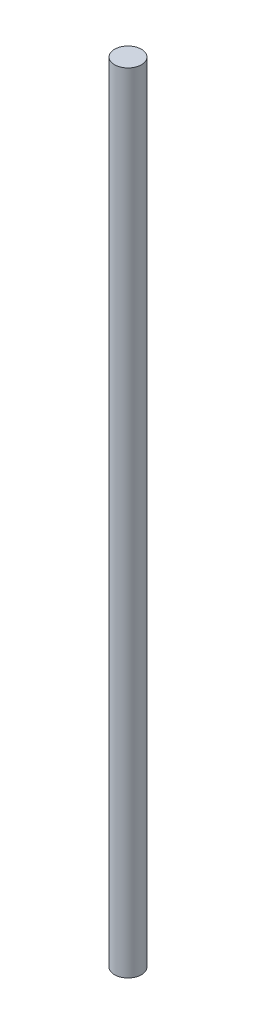
ISO-10303-21;
HEADER;
FILE_DESCRIPTION(('STEP AP214'),'2;1');
FILE_NAME('part.step','',(''),(''),'','','');
FILE_SCHEMA(('AUTOMOTIVE_DESIGN { 1 0 10303 214 1 1 1 1 }'));
ENDSEC;
DATA;
#1=APPLICATION_CONTEXT('core data for automotive mechanical design processes');
#2=APPLICATION_PROTOCOL_DEFINITION('international standard','automotive_design',2000,#1);
#3=PRODUCT_CONTEXT('',#1,'mechanical');
#4=PRODUCT('Part','Part','',(#3));
#5=PRODUCT_RELATED_PRODUCT_CATEGORY('part','',(#4));
#6=PRODUCT_DEFINITION_FORMATION('','',#4);
#7=PRODUCT_DEFINITION_CONTEXT('part definition',#1,'design');
#8=PRODUCT_DEFINITION('design','',#6,#7);
#9=PRODUCT_DEFINITION_SHAPE('','',#8);
#10=(LENGTH_UNIT() NAMED_UNIT(*) SI_UNIT(.MILLI.,.METRE.));
#11=(NAMED_UNIT(*) PLANE_ANGLE_UNIT() SI_UNIT($,.RADIAN.));
#12=(NAMED_UNIT(*) SI_UNIT($,.STERADIAN.) SOLID_ANGLE_UNIT());
#13=UNCERTAINTY_MEASURE_WITH_UNIT(LENGTH_MEASURE(1.E-05),#10,'distance_accuracy_value','');
#14=(GEOMETRIC_REPRESENTATION_CONTEXT(3) GLOBAL_UNCERTAINTY_ASSIGNED_CONTEXT((#13)) GLOBAL_UNIT_ASSIGNED_CONTEXT((#10,
#11,#12)) REPRESENTATION_CONTEXT('',''));
#15=CARTESIAN_POINT('',(0.,0.,0.));
#16=DIRECTION('',(0.,0.,1.));
#17=DIRECTION('',(1.,0.,0.));
#18=AXIS2_PLACEMENT_3D('',#15,#16,#17);
#19=CARTESIAN_POINT('',(0.,558.8,0.));
#20=DIRECTION('',(0.,-1.,0.));
#21=DIRECTION('',(0.,0.,-1.));
#22=AXIS2_PLACEMENT_3D('',#19,#20,#21);
#23=CYLINDRICAL_SURFACE('',#22,9.525);
#24=CARTESIAN_POINT('',(0.,558.8,0.));
#25=DIRECTION('',(0.,1.,0.));
#26=DIRECTION('',(0.,0.,1.));
#27=AXIS2_PLACEMENT_3D('',#24,#25,#26);
#28=CIRCLE('',#27,9.525);
#29=CARTESIAN_POINT('',(0.,558.8,9.525));
#30=VERTEX_POINT('',#29);
#31=EDGE_CURVE('E10',#30,#30,#28,.T.);
#32=ORIENTED_EDGE('',*,*,#31,.F.);
#33=EDGE_LOOP('',(#32));
#34=FACE_BOUND('',#33,.T.);
#35=CARTESIAN_POINT('',(0.,0.,0.));
#36=DIRECTION('',(0.,1.,0.));
#37=DIRECTION('',(0.,0.,1.));
#38=AXIS2_PLACEMENT_3D('',#35,#36,#37);
#39=CIRCLE('',#38,9.525);
#40=CARTESIAN_POINT('',(0.,0.,9.525));
#41=VERTEX_POINT('',#40);
#42=EDGE_CURVE('E38',#41,#41,#39,.T.);
#43=ORIENTED_EDGE('',*,*,#42,.T.);
#44=EDGE_LOOP('',(#43));
#45=FACE_BOUND('',#44,.T.);
#46=ADVANCED_FACE('F35',(#34,#45),#23,.T.);
#47=CARTESIAN_POINT('',(0.,558.8,0.));
#48=DIRECTION('',(0.,1.,0.));
#49=DIRECTION('',(0.,0.,1.));
#50=AXIS2_PLACEMENT_3D('',#47,#48,#49);
#51=PLANE('',#50);
#52=ORIENTED_EDGE('',*,*,#31,.T.);
#53=EDGE_LOOP('',(#52));
#54=FACE_BOUND('',#53,.T.);
#55=ADVANCED_FACE('F50',(#54),#51,.T.);
#56=CARTESIAN_POINT('',(0.,0.,0.));
#57=DIRECTION('',(0.,1.,0.));
#58=DIRECTION('',(0.,0.,1.));
#59=AXIS2_PLACEMENT_3D('',#56,#57,#58);
#60=PLANE('',#59);
#61=ORIENTED_EDGE('',*,*,#42,.F.);
#62=EDGE_LOOP('',(#61));
#63=FACE_BOUND('',#62,.T.);
#64=ADVANCED_FACE('F48',(#63),#60,.F.);
#65=CLOSED_SHELL('',(#46,#55,#64));
#66=MANIFOLD_SOLID_BREP('B2',#65);
#67=ADVANCED_BREP_SHAPE_REPRESENTATION('',(#18,#66),#14);
#68=SHAPE_DEFINITION_REPRESENTATION(#9,#67);
ENDSEC;
END-ISO-10303-21;
